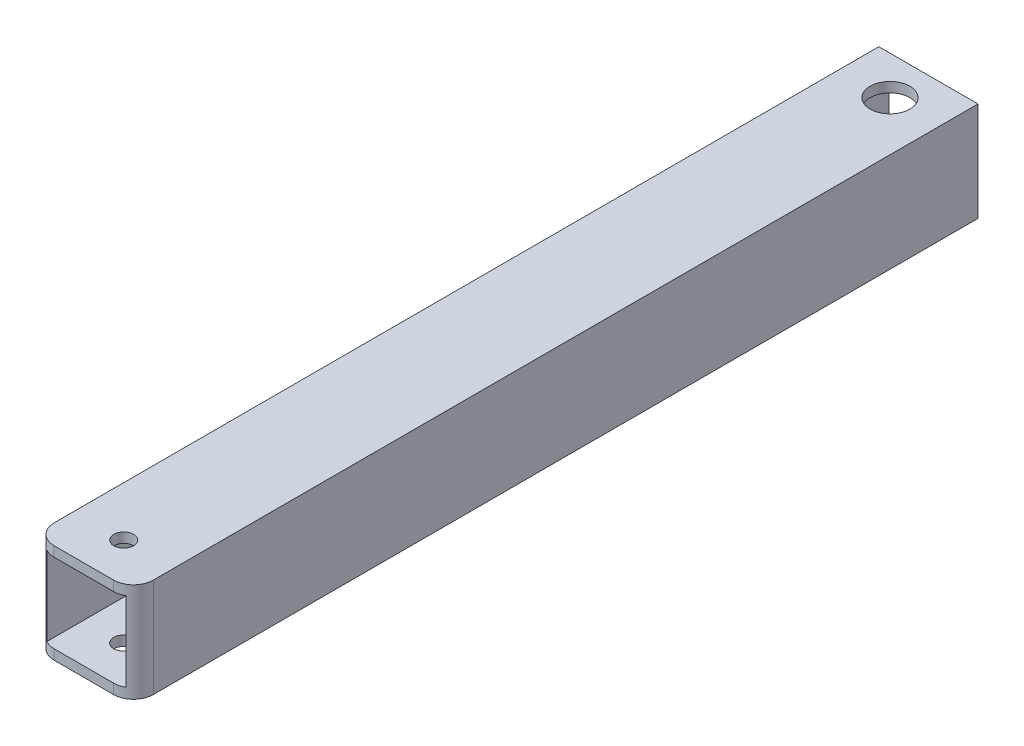
ISO-10303-21;
HEADER;
FILE_DESCRIPTION(('STEP AP214'),'2;1');
FILE_NAME('part.step','',(''),(''),'','','');
FILE_SCHEMA(('AUTOMOTIVE_DESIGN { 1 0 10303 214 1 1 1 1 }'));
ENDSEC;
DATA;
#1=APPLICATION_CONTEXT('core data for automotive mechanical design processes');
#2=APPLICATION_PROTOCOL_DEFINITION('international standard','automotive_design',2000,#1);
#3=PRODUCT_CONTEXT('',#1,'mechanical');
#4=PRODUCT('Part','Part','',(#3));
#5=PRODUCT_RELATED_PRODUCT_CATEGORY('part','',(#4));
#6=PRODUCT_DEFINITION_FORMATION('','',#4);
#7=PRODUCT_DEFINITION_CONTEXT('part definition',#1,'design');
#8=PRODUCT_DEFINITION('design','',#6,#7);
#9=PRODUCT_DEFINITION_SHAPE('','',#8);
#10=(LENGTH_UNIT() NAMED_UNIT(*) SI_UNIT(.MILLI.,.METRE.));
#11=(NAMED_UNIT(*) PLANE_ANGLE_UNIT() SI_UNIT($,.RADIAN.));
#12=(NAMED_UNIT(*) SI_UNIT($,.STERADIAN.) SOLID_ANGLE_UNIT());
#13=UNCERTAINTY_MEASURE_WITH_UNIT(LENGTH_MEASURE(1.E-05),#10,'distance_accuracy_value','');
#14=(GEOMETRIC_REPRESENTATION_CONTEXT(3) GLOBAL_UNCERTAINTY_ASSIGNED_CONTEXT((#13)) GLOBAL_UNIT_ASSIGNED_CONTEXT((#10,
#11,#12)) REPRESENTATION_CONTEXT('',''));
#15=CARTESIAN_POINT('',(0.,0.,0.));
#16=DIRECTION('',(0.,0.,1.));
#17=DIRECTION('',(1.,0.,0.));
#18=AXIS2_PLACEMENT_3D('',#15,#16,#17);
#19=CARTESIAN_POINT('',(0.,31.6865,269.875));
#20=DIRECTION('',(0.,0.,-1.));
#21=DIRECTION('',(-1.,0.,0.));
#22=AXIS2_PLACEMENT_3D('',#19,#20,#21);
#23=PLANE('',#22);
#24=DIRECTION('',(1.,0.,0.));
#25=VECTOR('',#24,1.);
#26=CARTESIAN_POINT('',(0.,0.,269.875));
#27=LINE('',#26,#25);
#28=CARTESIAN_POINT('',(6.35,0.,269.875));
#29=VERTEX_POINT('',#28);
#30=CARTESIAN_POINT('',(25.3365,0.,269.875));
#31=VERTEX_POINT('',#30);
#32=EDGE_CURVE('E160',#29,#31,#27,.T.);
#33=ORIENTED_EDGE('',*,*,#32,.T.);
#34=DIRECTION('',(0.,1.,0.));
#35=VECTOR('',#34,1.);
#36=CARTESIAN_POINT('',(25.3365,31.6865,269.875));
#37=LINE('',#36,#35);
#38=CARTESIAN_POINT('',(25.3365,3.175,269.875));
#39=VERTEX_POINT('',#38);
#40=EDGE_CURVE('E202',#31,#39,#37,.T.);
#41=ORIENTED_EDGE('',*,*,#40,.T.);
#42=DIRECTION('',(-1.,0.,0.));
#43=VECTOR('',#42,1.);
#44=CARTESIAN_POINT('',(28.5115,3.175,269.875));
#45=LINE('',#44,#43);
#46=CARTESIAN_POINT('',(6.35,3.175,269.875));
#47=VERTEX_POINT('',#46);
#48=EDGE_CURVE('E150',#39,#47,#45,.T.);
#49=ORIENTED_EDGE('',*,*,#48,.T.);
#50=DIRECTION('',(0.,-1.,0.));
#51=VECTOR('',#50,1.);
#52=CARTESIAN_POINT('',(6.35,31.6865,269.875));
#53=LINE('',#52,#51);
#54=EDGE_CURVE('E185',#47,#29,#53,.T.);
#55=ORIENTED_EDGE('',*,*,#54,.T.);
#56=EDGE_LOOP('',(#33,#41,#49,#55));
#57=FACE_BOUND('',#56,.T.);
#58=ADVANCED_FACE('F32',(#57),#23,.F.);
#59=CARTESIAN_POINT('',(0.,0.,269.875));
#60=DIRECTION('',(1.,0.,0.));
#61=DIRECTION('',(0.,1.,0.));
#62=AXIS2_PLACEMENT_3D('',#59,#60,#61);
#63=PLANE('',#62);
#64=DIRECTION('',(0.,0.,-1.));
#65=VECTOR('',#64,1.);
#66=CARTESIAN_POINT('',(0.,0.,269.875));
#67=LINE('',#66,#65);
#68=CARTESIAN_POINT('',(0.,0.,263.525));
#69=VERTEX_POINT('',#68);
#70=CARTESIAN_POINT('',(0.,0.,0.));
#71=VERTEX_POINT('',#70);
#72=EDGE_CURVE('E183',#69,#71,#67,.T.);
#73=ORIENTED_EDGE('',*,*,#72,.F.);
#74=DIRECTION('',(0.,-1.,0.));
#75=VECTOR('',#74,1.);
#76=CARTESIAN_POINT('',(0.,0.,263.525));
#77=LINE('',#76,#75);
#78=CARTESIAN_POINT('',(0.,31.6865,263.525));
#79=VERTEX_POINT('',#78);
#80=EDGE_CURVE('E11',#69,#79,#77,.F.);
#81=ORIENTED_EDGE('',*,*,#80,.T.);
#82=DIRECTION('',(0.,0.,-1.));
#83=VECTOR('',#82,1.);
#84=CARTESIAN_POINT('',(0.,31.6865,269.875));
#85=LINE('',#84,#83);
#86=CARTESIAN_POINT('',(0.,31.6865,0.));
#87=VERTEX_POINT('',#86);
#88=EDGE_CURVE('E167',#79,#87,#85,.T.);
#89=ORIENTED_EDGE('',*,*,#88,.T.);
#90=DIRECTION('',(0.,-1.,0.));
#91=VECTOR('',#90,1.);
#92=CARTESIAN_POINT('',(0.,0.,0.));
#93=LINE('',#92,#91);
#94=EDGE_CURVE('E156',#87,#71,#93,.T.);
#95=ORIENTED_EDGE('',*,*,#94,.T.);
#96=EDGE_LOOP('',(#73,#81,#89,#95));
#97=FACE_BOUND('',#96,.T.);
#98=ADVANCED_FACE('F280',(#97),#63,.F.);
#99=CARTESIAN_POINT('',(0.,0.,269.875));
#100=DIRECTION('',(0.,1.,0.));
#101=DIRECTION('',(0.,0.,1.));
#102=AXIS2_PLACEMENT_3D('',#99,#100,#101);
#103=PLANE('',#102);
#104=CARTESIAN_POINT('',(15.875,0.,12.319));
#105=DIRECTION('',(0.,1.,0.));
#106=DIRECTION('',(0.,0.,1.));
#107=AXIS2_PLACEMENT_3D('',#104,#105,#106);
#108=CIRCLE('',#107,6.35);
#109=CARTESIAN_POINT('',(15.875,0.,18.669));
#110=VERTEX_POINT('',#109);
#111=EDGE_CURVE('E195',#110,#110,#108,.T.);
#112=ORIENTED_EDGE('',*,*,#111,.T.);
#113=EDGE_LOOP('',(#112));
#114=FACE_BOUND('',#113,.T.);
#115=CARTESIAN_POINT('',(15.875,0.,257.175));
#116=DIRECTION('',(0.,1.,0.));
#117=DIRECTION('',(0.,0.,1.));
#118=AXIS2_PLACEMENT_3D('',#115,#116,#117);
#119=CIRCLE('',#118,3.17500000000015);
#120=CARTESIAN_POINT('',(15.875,0.,260.35));
#121=VERTEX_POINT('',#120);
#122=EDGE_CURVE('E190',#121,#121,#119,.T.);
#123=ORIENTED_EDGE('',*,*,#122,.T.);
#124=EDGE_LOOP('',(#123));
#125=FACE_BOUND('',#124,.T.);
#126=DIRECTION('',(0.,0.,-1.));
#127=VECTOR('',#126,1.);
#128=CARTESIAN_POINT('',(31.6865,0.,269.875));
#129=LINE('',#128,#127);
#130=CARTESIAN_POINT('',(31.6865,0.,263.525));
#131=VERTEX_POINT('',#130);
#132=CARTESIAN_POINT('',(31.6865,0.,0.));
#133=VERTEX_POINT('',#132);
#134=EDGE_CURVE('E181',#131,#133,#129,.T.);
#135=ORIENTED_EDGE('',*,*,#134,.F.);
#136=CARTESIAN_POINT('',(25.3365,0.,263.525));
#137=DIRECTION('',(0.,1.,0.));
#138=DIRECTION('',(0.,0.,1.));
#139=AXIS2_PLACEMENT_3D('',#136,#137,#138);
#140=CIRCLE('',#139,6.35);
#141=EDGE_CURVE('E221',#131,#31,#140,.F.);
#142=ORIENTED_EDGE('',*,*,#141,.T.);
#143=ORIENTED_EDGE('',*,*,#32,.F.);
#144=CARTESIAN_POINT('',(6.35,0.,263.525));
#145=DIRECTION('',(0.,1.,0.));
#146=DIRECTION('',(0.,0.,1.));
#147=AXIS2_PLACEMENT_3D('',#144,#145,#146);
#148=CIRCLE('',#147,6.35);
#149=EDGE_CURVE('E47',#29,#69,#148,.F.);
#150=ORIENTED_EDGE('',*,*,#149,.T.);
#151=ORIENTED_EDGE('',*,*,#72,.T.);
#152=DIRECTION('',(1.,0.,0.));
#153=VECTOR('',#152,1.);
#154=CARTESIAN_POINT('',(0.,0.,0.));
#155=LINE('',#154,#153);
#156=EDGE_CURVE('E170',#71,#133,#155,.T.);
#157=ORIENTED_EDGE('',*,*,#156,.T.);
#158=EDGE_LOOP('',(#135,#142,#143,#150,#151,#157));
#159=FACE_BOUND('',#158,.T.);
#160=ADVANCED_FACE('F223',(#114,#125,#159),#103,.F.);
#161=CARTESIAN_POINT('',(31.6865,0.,269.875));
#162=DIRECTION('',(-1.,0.,0.));
#163=DIRECTION('',(0.,-1.,0.));
#164=AXIS2_PLACEMENT_3D('',#161,#162,#163);
#165=PLANE('',#164);
#166=DIRECTION('',(0.,0.,-1.));
#167=VECTOR('',#166,1.);
#168=CARTESIAN_POINT('',(31.6865,31.6865,269.875));
#169=LINE('',#168,#167);
#170=CARTESIAN_POINT('',(31.6865,31.6865,263.525));
#171=VERTEX_POINT('',#170);
#172=CARTESIAN_POINT('',(31.6865,31.6865,0.));
#173=VERTEX_POINT('',#172);
#174=EDGE_CURVE('E179',#171,#173,#169,.T.);
#175=ORIENTED_EDGE('',*,*,#174,.F.);
#176=DIRECTION('',(0.,1.,0.));
#177=VECTOR('',#176,1.);
#178=CARTESIAN_POINT('',(31.6865,0.,263.525));
#179=LINE('',#178,#177);
#180=EDGE_CURVE('E55',#171,#131,#179,.F.);
#181=ORIENTED_EDGE('',*,*,#180,.T.);
#182=ORIENTED_EDGE('',*,*,#134,.T.);
#183=DIRECTION('',(0.,1.,0.));
#184=VECTOR('',#183,1.);
#185=CARTESIAN_POINT('',(31.6865,0.,0.));
#186=LINE('',#185,#184);
#187=EDGE_CURVE('E173',#133,#173,#186,.T.);
#188=ORIENTED_EDGE('',*,*,#187,.T.);
#189=EDGE_LOOP('',(#175,#181,#182,#188));
#190=FACE_BOUND('',#189,.T.);
#191=ADVANCED_FACE('F297',(#190),#165,.F.);
#192=CARTESIAN_POINT('',(0.,31.6865,269.875));
#193=DIRECTION('',(0.,-1.,0.));
#194=DIRECTION('',(0.,0.,-1.));
#195=AXIS2_PLACEMENT_3D('',#192,#193,#194);
#196=PLANE('',#195);
#197=CARTESIAN_POINT('',(15.875,31.6865,12.319));
#198=DIRECTION('',(0.,1.,0.));
#199=DIRECTION('',(0.,0.,1.));
#200=AXIS2_PLACEMENT_3D('',#197,#198,#199);
#201=CIRCLE('',#200,6.35);
#202=CARTESIAN_POINT('',(15.875,31.6865,18.669));
#203=VERTEX_POINT('',#202);
#204=EDGE_CURVE('E248',#203,#203,#201,.T.);
#205=ORIENTED_EDGE('',*,*,#204,.F.);
#206=EDGE_LOOP('',(#205));
#207=FACE_BOUND('',#206,.T.);
#208=CARTESIAN_POINT('',(15.875,31.6865,257.175));
#209=DIRECTION('',(0.,1.,0.));
#210=DIRECTION('',(0.,0.,1.));
#211=AXIS2_PLACEMENT_3D('',#208,#209,#210);
#212=CIRCLE('',#211,3.17500000000015);
#213=CARTESIAN_POINT('',(15.875,31.6865,260.35));
#214=VERTEX_POINT('',#213);
#215=EDGE_CURVE('E241',#214,#214,#212,.T.);
#216=ORIENTED_EDGE('',*,*,#215,.F.);
#217=EDGE_LOOP('',(#216));
#218=FACE_BOUND('',#217,.T.);
#219=DIRECTION('',(-1.,0.,0.));
#220=VECTOR('',#219,1.);
#221=CARTESIAN_POINT('',(0.,31.6865,269.875));
#222=LINE('',#221,#220);
#223=CARTESIAN_POINT('',(25.3365,31.6865,269.875));
#224=VERTEX_POINT('',#223);
#225=CARTESIAN_POINT('',(6.35,31.6865,269.875));
#226=VERTEX_POINT('',#225);
#227=EDGE_CURVE('E163',#224,#226,#222,.T.);
#228=ORIENTED_EDGE('',*,*,#227,.F.);
#229=CARTESIAN_POINT('',(25.3365,31.6865,263.525));
#230=DIRECTION('',(0.,-1.,0.));
#231=DIRECTION('',(0.,0.,-1.));
#232=AXIS2_PLACEMENT_3D('',#229,#230,#231);
#233=CIRCLE('',#232,6.35);
#234=EDGE_CURVE('E217',#224,#171,#233,.F.);
#235=ORIENTED_EDGE('',*,*,#234,.T.);
#236=ORIENTED_EDGE('',*,*,#174,.T.);
#237=DIRECTION('',(-1.,0.,0.));
#238=VECTOR('',#237,1.);
#239=CARTESIAN_POINT('',(0.,31.6865,0.));
#240=LINE('',#239,#238);
#241=EDGE_CURVE('E164',#173,#87,#240,.T.);
#242=ORIENTED_EDGE('',*,*,#241,.T.);
#243=ORIENTED_EDGE('',*,*,#88,.F.);
#244=CARTESIAN_POINT('',(6.35,31.6865,263.525));
#245=DIRECTION('',(0.,-1.,0.));
#246=DIRECTION('',(0.,0.,-1.));
#247=AXIS2_PLACEMENT_3D('',#244,#245,#246);
#248=CIRCLE('',#247,6.35);
#249=EDGE_CURVE('E215',#79,#226,#248,.F.);
#250=ORIENTED_EDGE('',*,*,#249,.T.);
#251=EDGE_LOOP('',(#228,#235,#236,#242,#243,#250));
#252=FACE_BOUND('',#251,.T.);
#253=ADVANCED_FACE('F291',(#207,#218,#252),#196,.F.);
#254=DIRECTION('',(1.,0.,0.));
#255=VECTOR('',#254,1.);
#256=CARTESIAN_POINT('',(3.175,28.5115,269.875));
#257=LINE('',#256,#255);
#258=CARTESIAN_POINT('',(6.35,28.5115,269.875));
#259=VERTEX_POINT('',#258);
#260=CARTESIAN_POINT('',(25.3365,28.5115,269.875));
#261=VERTEX_POINT('',#260);
#262=EDGE_CURVE('E159',#259,#261,#257,.T.);
#263=ORIENTED_EDGE('',*,*,#262,.T.);
#264=DIRECTION('',(0.,1.,0.));
#265=VECTOR('',#264,1.);
#266=CARTESIAN_POINT('',(25.3365,31.6865,269.875));
#267=LINE('',#266,#265);
#268=EDGE_CURVE('E200',#261,#224,#267,.T.);
#269=ORIENTED_EDGE('',*,*,#268,.T.);
#270=ORIENTED_EDGE('',*,*,#227,.T.);
#271=DIRECTION('',(0.,-1.,0.));
#272=VECTOR('',#271,1.);
#273=CARTESIAN_POINT('',(6.35,31.6865,269.875));
#274=LINE('',#273,#272);
#275=EDGE_CURVE('E197',#226,#259,#274,.T.);
#276=ORIENTED_EDGE('',*,*,#275,.T.);
#277=EDGE_LOOP('',(#263,#269,#270,#276));
#278=FACE_BOUND('',#277,.T.);
#279=ADVANCED_FACE('F282',(#278),#23,.F.);
#280=CARTESIAN_POINT('',(0.,31.6865,0.));
#281=DIRECTION('',(0.,0.,-1.));
#282=DIRECTION('',(-1.,0.,0.));
#283=AXIS2_PLACEMENT_3D('',#280,#281,#282);
#284=PLANE('',#283);
#285=DIRECTION('',(0.,-1.,0.));
#286=VECTOR('',#285,1.);
#287=CARTESIAN_POINT('',(28.5115,28.5115,0.));
#288=LINE('',#287,#286);
#289=CARTESIAN_POINT('',(28.5115,28.5115,0.));
#290=VERTEX_POINT('',#289);
#291=CARTESIAN_POINT('',(28.5115,3.175,0.));
#292=VERTEX_POINT('',#291);
#293=EDGE_CURVE('E143',#290,#292,#288,.T.);
#294=ORIENTED_EDGE('',*,*,#293,.F.);
#295=DIRECTION('',(1.,0.,0.));
#296=VECTOR('',#295,1.);
#297=CARTESIAN_POINT('',(3.175,28.5115,0.));
#298=LINE('',#297,#296);
#299=CARTESIAN_POINT('',(3.175,28.5115,0.));
#300=VERTEX_POINT('',#299);
#301=EDGE_CURVE('E148',#300,#290,#298,.T.);
#302=ORIENTED_EDGE('',*,*,#301,.F.);
#303=DIRECTION('',(0.,1.,0.));
#304=VECTOR('',#303,1.);
#305=CARTESIAN_POINT('',(3.175,3.175,0.));
#306=LINE('',#305,#304);
#307=CARTESIAN_POINT('',(3.175,3.175,0.));
#308=VERTEX_POINT('',#307);
#309=EDGE_CURVE('E127',#308,#300,#306,.T.);
#310=ORIENTED_EDGE('',*,*,#309,.F.);
#311=DIRECTION('',(-1.,0.,0.));
#312=VECTOR('',#311,1.);
#313=CARTESIAN_POINT('',(28.5115,3.175,0.));
#314=LINE('',#313,#312);
#315=EDGE_CURVE('E136',#292,#308,#314,.T.);
#316=ORIENTED_EDGE('',*,*,#315,.F.);
#317=EDGE_LOOP('',(#294,#302,#310,#316));
#318=FACE_BOUND('',#317,.T.);
#319=ORIENTED_EDGE('',*,*,#94,.F.);
#320=ORIENTED_EDGE('',*,*,#241,.F.);
#321=ORIENTED_EDGE('',*,*,#187,.F.);
#322=ORIENTED_EDGE('',*,*,#156,.F.);
#323=EDGE_LOOP('',(#319,#320,#321,#322));
#324=FACE_BOUND('',#323,.T.);
#325=ADVANCED_FACE('F145',(#318,#324),#284,.T.);
#326=CARTESIAN_POINT('',(28.5115,28.5115,269.875));
#327=DIRECTION('',(1.,0.,0.));
#328=DIRECTION('',(0.,1.,0.));
#329=AXIS2_PLACEMENT_3D('',#326,#327,#328);
#330=PLANE('',#329);
#331=DIRECTION('',(0.,0.,-1.));
#332=VECTOR('',#331,1.);
#333=CARTESIAN_POINT('',(28.5115,3.175,269.875));
#334=LINE('',#333,#332);
#335=CARTESIAN_POINT('',(28.5115,3.175,269.024261314031));
#336=VERTEX_POINT('',#335);
#337=EDGE_CURVE('E133',#336,#292,#334,.T.);
#338=ORIENTED_EDGE('',*,*,#337,.F.);
#339=DIRECTION('',(0.,1.,0.));
#340=VECTOR('',#339,1.);
#341=CARTESIAN_POINT('',(28.5115,3.175,269.024261314031));
#342=LINE('',#341,#340);
#343=CARTESIAN_POINT('',(28.5115,28.5115,269.024261314031));
#344=VERTEX_POINT('',#343);
#345=EDGE_CURVE('E209',#336,#344,#342,.T.);
#346=ORIENTED_EDGE('',*,*,#345,.T.);
#347=DIRECTION('',(0.,0.,-1.));
#348=VECTOR('',#347,1.);
#349=CARTESIAN_POINT('',(28.5115,28.5115,269.875));
#350=LINE('',#349,#348);
#351=EDGE_CURVE('E154',#344,#290,#350,.T.);
#352=ORIENTED_EDGE('',*,*,#351,.T.);
#353=ORIENTED_EDGE('',*,*,#293,.T.);
#354=EDGE_LOOP('',(#338,#346,#352,#353));
#355=FACE_BOUND('',#354,.T.);
#356=ADVANCED_FACE('F233',(#355),#330,.F.);
#357=CARTESIAN_POINT('',(3.175,28.5115,269.875));
#358=DIRECTION('',(0.,1.,0.));
#359=DIRECTION('',(0.,0.,1.));
#360=AXIS2_PLACEMENT_3D('',#357,#358,#359);
#361=PLANE('',#360);
#362=CARTESIAN_POINT('',(15.875,28.5115,12.319));
#363=DIRECTION('',(0.,1.,0.));
#364=DIRECTION('',(0.,0.,1.));
#365=AXIS2_PLACEMENT_3D('',#362,#363,#364);
#366=CIRCLE('',#365,6.35);
#367=CARTESIAN_POINT('',(15.875,28.5115,18.669));
#368=VERTEX_POINT('',#367);
#369=EDGE_CURVE('E194',#368,#368,#366,.T.);
#370=ORIENTED_EDGE('',*,*,#369,.T.);
#371=EDGE_LOOP('',(#370));
#372=FACE_BOUND('',#371,.T.);
#373=CARTESIAN_POINT('',(15.875,28.5115,257.175));
#374=DIRECTION('',(0.,1.,0.));
#375=DIRECTION('',(0.,0.,1.));
#376=AXIS2_PLACEMENT_3D('',#373,#374,#375);
#377=CIRCLE('',#376,3.17500000000015);
#378=CARTESIAN_POINT('',(15.875,28.5115,260.35));
#379=VERTEX_POINT('',#378);
#380=EDGE_CURVE('E189',#379,#379,#377,.T.);
#381=ORIENTED_EDGE('',*,*,#380,.T.);
#382=EDGE_LOOP('',(#381));
#383=FACE_BOUND('',#382,.T.);
#384=ORIENTED_EDGE('',*,*,#351,.F.);
#385=CARTESIAN_POINT('',(25.3365,28.5115,263.525));
#386=DIRECTION('',(0.,1.,0.));
#387=DIRECTION('',(0.,0.,1.));
#388=AXIS2_PLACEMENT_3D('',#385,#386,#387);
#389=CIRCLE('',#388,6.35);
#390=EDGE_CURVE('E213',#344,#261,#389,.F.);
#391=ORIENTED_EDGE('',*,*,#390,.T.);
#392=ORIENTED_EDGE('',*,*,#262,.F.);
#393=CARTESIAN_POINT('',(6.35,28.5115,263.525));
#394=DIRECTION('',(0.,1.,0.));
#395=DIRECTION('',(0.,0.,1.));
#396=AXIS2_PLACEMENT_3D('',#393,#394,#395);
#397=CIRCLE('',#396,6.35);
#398=CARTESIAN_POINT('',(3.175,28.5115,269.024261314031));
#399=VERTEX_POINT('',#398);
#400=EDGE_CURVE('E211',#259,#399,#397,.F.);
#401=ORIENTED_EDGE('',*,*,#400,.T.);
#402=DIRECTION('',(0.,0.,-1.));
#403=VECTOR('',#402,1.);
#404=CARTESIAN_POINT('',(3.175,28.5115,269.875));
#405=LINE('',#404,#403);
#406=EDGE_CURVE('E132',#399,#300,#405,.T.);
#407=ORIENTED_EDGE('',*,*,#406,.T.);
#408=ORIENTED_EDGE('',*,*,#301,.T.);
#409=EDGE_LOOP('',(#384,#391,#392,#401,#407,#408));
#410=FACE_BOUND('',#409,.T.);
#411=ADVANCED_FACE('F315',(#372,#383,#410),#361,.F.);
#412=CARTESIAN_POINT('',(3.175,3.175,269.875));
#413=DIRECTION('',(-1.,0.,0.));
#414=DIRECTION('',(0.,-1.,0.));
#415=AXIS2_PLACEMENT_3D('',#412,#413,#414);
#416=PLANE('',#415);
#417=ORIENTED_EDGE('',*,*,#406,.F.);
#418=DIRECTION('',(0.,-1.,0.));
#419=VECTOR('',#418,1.);
#420=CARTESIAN_POINT('',(3.175,28.5115,269.024261314031));
#421=LINE('',#420,#419);
#422=CARTESIAN_POINT('',(3.175,3.175,269.024261314031));
#423=VERTEX_POINT('',#422);
#424=EDGE_CURVE('E40',#399,#423,#421,.T.);
#425=ORIENTED_EDGE('',*,*,#424,.T.);
#426=DIRECTION('',(0.,0.,-1.));
#427=VECTOR('',#426,1.);
#428=CARTESIAN_POINT('',(3.175,3.175,269.875));
#429=LINE('',#428,#427);
#430=EDGE_CURVE('E122',#423,#308,#429,.T.);
#431=ORIENTED_EDGE('',*,*,#430,.T.);
#432=ORIENTED_EDGE('',*,*,#309,.T.);
#433=EDGE_LOOP('',(#417,#425,#431,#432));
#434=FACE_BOUND('',#433,.T.);
#435=ADVANCED_FACE('F125',(#434),#416,.F.);
#436=CARTESIAN_POINT('',(28.5115,3.175,269.875));
#437=DIRECTION('',(0.,-1.,0.));
#438=DIRECTION('',(0.,0.,-1.));
#439=AXIS2_PLACEMENT_3D('',#436,#437,#438);
#440=PLANE('',#439);
#441=CARTESIAN_POINT('',(15.875,3.175,12.319));
#442=DIRECTION('',(0.,-1.,0.));
#443=DIRECTION('',(0.,0.,-1.));
#444=AXIS2_PLACEMENT_3D('',#441,#442,#443);
#445=CIRCLE('',#444,6.35);
#446=CARTESIAN_POINT('',(15.875,3.175,5.969));
#447=VERTEX_POINT('',#446);
#448=EDGE_CURVE('E191',#447,#447,#445,.T.);
#449=ORIENTED_EDGE('',*,*,#448,.T.);
#450=EDGE_LOOP('',(#449));
#451=FACE_BOUND('',#450,.T.);
#452=CARTESIAN_POINT('',(15.875,3.175,257.175));
#453=DIRECTION('',(0.,-1.,0.));
#454=DIRECTION('',(0.,0.,-1.));
#455=AXIS2_PLACEMENT_3D('',#452,#453,#454);
#456=CIRCLE('',#455,3.17500000000015);
#457=CARTESIAN_POINT('',(15.875,3.175,254.));
#458=VERTEX_POINT('',#457);
#459=EDGE_CURVE('E186',#458,#458,#456,.T.);
#460=ORIENTED_EDGE('',*,*,#459,.T.);
#461=EDGE_LOOP('',(#460));
#462=FACE_BOUND('',#461,.T.);
#463=ORIENTED_EDGE('',*,*,#48,.F.);
#464=CARTESIAN_POINT('',(25.3365,3.175,263.525));
#465=DIRECTION('',(0.,-1.,0.));
#466=DIRECTION('',(0.,0.,-1.));
#467=AXIS2_PLACEMENT_3D('',#464,#465,#466);
#468=CIRCLE('',#467,6.35);
#469=EDGE_CURVE('E207',#39,#336,#468,.F.);
#470=ORIENTED_EDGE('',*,*,#469,.T.);
#471=ORIENTED_EDGE('',*,*,#337,.T.);
#472=ORIENTED_EDGE('',*,*,#315,.T.);
#473=ORIENTED_EDGE('',*,*,#430,.F.);
#474=CARTESIAN_POINT('',(6.35,3.175,263.525));
#475=DIRECTION('',(0.,-1.,0.));
#476=DIRECTION('',(0.,0.,-1.));
#477=AXIS2_PLACEMENT_3D('',#474,#475,#476);
#478=CIRCLE('',#477,6.35);
#479=EDGE_CURVE('E205',#423,#47,#478,.F.);
#480=ORIENTED_EDGE('',*,*,#479,.T.);
#481=EDGE_LOOP('',(#463,#470,#471,#472,#473,#480));
#482=FACE_BOUND('',#481,.T.);
#483=ADVANCED_FACE('F138',(#451,#462,#482),#440,.F.);
#484=CARTESIAN_POINT('',(15.875,0.,257.175));
#485=DIRECTION('',(0.,1.,0.));
#486=DIRECTION('',(0.,0.,1.));
#487=AXIS2_PLACEMENT_3D('',#484,#485,#486);
#488=CYLINDRICAL_SURFACE('',#487,3.17500000000015);
#489=ORIENTED_EDGE('',*,*,#122,.F.);
#490=EDGE_LOOP('',(#489));
#491=FACE_BOUND('',#490,.T.);
#492=ORIENTED_EDGE('',*,*,#459,.F.);
#493=EDGE_LOOP('',(#492));
#494=FACE_BOUND('',#493,.T.);
#495=ADVANCED_FACE('F266',(#491,#494),#488,.F.);
#496=ORIENTED_EDGE('',*,*,#215,.T.);
#497=EDGE_LOOP('',(#496));
#498=FACE_BOUND('',#497,.T.);
#499=ORIENTED_EDGE('',*,*,#380,.F.);
#500=EDGE_LOOP('',(#499));
#501=FACE_BOUND('',#500,.T.);
#502=ADVANCED_FACE('F260',(#498,#501),#488,.F.);
#503=CARTESIAN_POINT('',(15.875,0.,12.319));
#504=DIRECTION('',(0.,1.,0.));
#505=DIRECTION('',(0.,0.,1.));
#506=AXIS2_PLACEMENT_3D('',#503,#504,#505);
#507=CYLINDRICAL_SURFACE('',#506,6.35);
#508=ORIENTED_EDGE('',*,*,#111,.F.);
#509=EDGE_LOOP('',(#508));
#510=FACE_BOUND('',#509,.T.);
#511=ORIENTED_EDGE('',*,*,#448,.F.);
#512=EDGE_LOOP('',(#511));
#513=FACE_BOUND('',#512,.T.);
#514=ADVANCED_FACE('F256',(#510,#513),#507,.F.);
#515=ORIENTED_EDGE('',*,*,#204,.T.);
#516=EDGE_LOOP('',(#515));
#517=FACE_BOUND('',#516,.T.);
#518=ORIENTED_EDGE('',*,*,#369,.F.);
#519=EDGE_LOOP('',(#518));
#520=FACE_BOUND('',#519,.T.);
#521=ADVANCED_FACE('F259',(#517,#520),#507,.F.);
#522=CARTESIAN_POINT('',(25.3365,31.6865,263.525));
#523=DIRECTION('',(0.,1.,0.));
#524=DIRECTION('',(-1.,0.,0.));
#525=AXIS2_PLACEMENT_3D('',#522,#523,#524);
#526=CYLINDRICAL_SURFACE('',#525,6.35);
#527=ORIENTED_EDGE('',*,*,#141,.F.);
#528=ORIENTED_EDGE('',*,*,#180,.F.);
#529=ORIENTED_EDGE('',*,*,#234,.F.);
#530=ORIENTED_EDGE('',*,*,#268,.F.);
#531=ORIENTED_EDGE('',*,*,#390,.F.);
#532=ORIENTED_EDGE('',*,*,#345,.F.);
#533=ORIENTED_EDGE('',*,*,#469,.F.);
#534=ORIENTED_EDGE('',*,*,#40,.F.);
#535=EDGE_LOOP('',(#527,#528,#529,#530,#531,#532,#533,#534));
#536=FACE_BOUND('',#535,.T.);
#537=ADVANCED_FACE('F229',(#536),#526,.T.);
#538=CARTESIAN_POINT('',(6.35,31.6865,263.525));
#539=DIRECTION('',(0.,-1.,0.));
#540=DIRECTION('',(1.,0.,0.));
#541=AXIS2_PLACEMENT_3D('',#538,#539,#540);
#542=CYLINDRICAL_SURFACE('',#541,6.35);
#543=ORIENTED_EDGE('',*,*,#249,.F.);
#544=ORIENTED_EDGE('',*,*,#80,.F.);
#545=ORIENTED_EDGE('',*,*,#149,.F.);
#546=ORIENTED_EDGE('',*,*,#54,.F.);
#547=ORIENTED_EDGE('',*,*,#479,.F.);
#548=ORIENTED_EDGE('',*,*,#424,.F.);
#549=ORIENTED_EDGE('',*,*,#400,.F.);
#550=ORIENTED_EDGE('',*,*,#275,.F.);
#551=EDGE_LOOP('',(#543,#544,#545,#546,#547,#548,#549,#550));
#552=FACE_BOUND('',#551,.T.);
#553=ADVANCED_FACE('F34',(#552),#542,.T.);
#554=CLOSED_SHELL('',(#58,#98,#160,#191,#253,#279,#325,#356,#411,#435,#483,#495,#502,#514,#521,
#537,#553));
#555=MANIFOLD_SOLID_BREP('B2',#554);
#556=ADVANCED_BREP_SHAPE_REPRESENTATION('',(#18,#555),#14);
#557=SHAPE_DEFINITION_REPRESENTATION(#9,#556);
ENDSEC;
END-ISO-10303-21;
